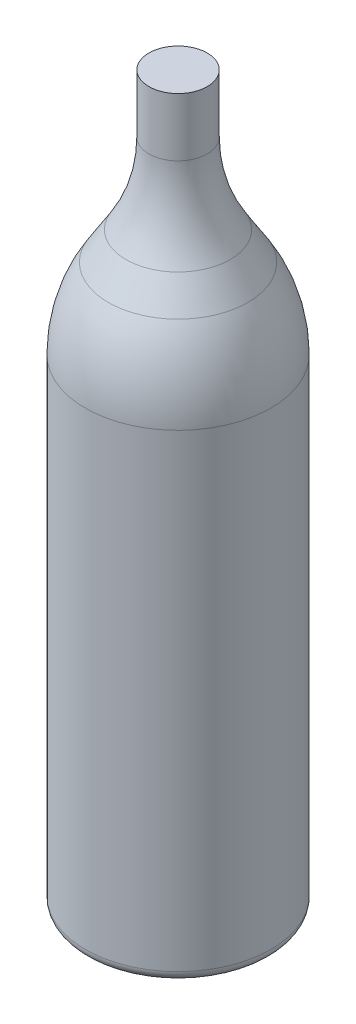
ISO-10303-21;
HEADER;
FILE_DESCRIPTION(('STEP AP214'),'2;1');
FILE_NAME('part.step','',(''),(''),'','','');
FILE_SCHEMA(('AUTOMOTIVE_DESIGN { 1 0 10303 214 1 1 1 1 }'));
ENDSEC;
DATA;
#1=APPLICATION_CONTEXT('core data for automotive mechanical design processes');
#2=APPLICATION_PROTOCOL_DEFINITION('international standard','automotive_design',2000,#1);
#3=PRODUCT_CONTEXT('',#1,'mechanical');
#4=PRODUCT('Part','Part','',(#3));
#5=PRODUCT_RELATED_PRODUCT_CATEGORY('part','',(#4));
#6=PRODUCT_DEFINITION_FORMATION('','',#4);
#7=PRODUCT_DEFINITION_CONTEXT('part definition',#1,'design');
#8=PRODUCT_DEFINITION('design','',#6,#7);
#9=PRODUCT_DEFINITION_SHAPE('','',#8);
#10=(LENGTH_UNIT() NAMED_UNIT(*) SI_UNIT(.MILLI.,.METRE.));
#11=(NAMED_UNIT(*) PLANE_ANGLE_UNIT() SI_UNIT($,.RADIAN.));
#12=(NAMED_UNIT(*) SI_UNIT($,.STERADIAN.) SOLID_ANGLE_UNIT());
#13=UNCERTAINTY_MEASURE_WITH_UNIT(LENGTH_MEASURE(1.E-05),#10,'distance_accuracy_value','');
#14=(GEOMETRIC_REPRESENTATION_CONTEXT(3) GLOBAL_UNCERTAINTY_ASSIGNED_CONTEXT((#13)) GLOBAL_UNIT_ASSIGNED_CONTEXT((#10,
#11,#12)) REPRESENTATION_CONTEXT('',''));
#15=CARTESIAN_POINT('',(0.,0.,0.));
#16=DIRECTION('',(0.,0.,1.));
#17=DIRECTION('',(1.,0.,0.));
#18=AXIS2_PLACEMENT_3D('',#15,#16,#17);
#19=CARTESIAN_POINT('',(0.,10.7696049141904,0.));
#20=DIRECTION('',(0.,-1.,0.));
#21=DIRECTION('',(-1.,0.,0.));
#22=AXIS2_PLACEMENT_3D('',#19,#20,#21);
#23=SPHERICAL_SURFACE('',#22,11.6870399867786);
#24=CARTESIAN_POINT('',(0.,18.9344835735498,0.));
#25=DIRECTION('',(0.,-1.,0.));
#26=DIRECTION('',(0.,0.,-1.));
#27=AXIS2_PLACEMENT_3D('',#24,#25,#26);
#28=CIRCLE('',#27,8.36191725207209);
#29=CARTESIAN_POINT('',(0.,18.9344835735498,-8.36191725207209));
#30=VERTEX_POINT('',#29);
#31=EDGE_CURVE('E10',#30,#30,#28,.T.);
#32=ORIENTED_EDGE('',*,*,#31,.T.);
#33=EDGE_LOOP('',(#32));
#34=FACE_BOUND('',#33,.T.);
#35=ADVANCED_FACE('F31',(#34),#23,.F.);
#36=CARTESIAN_POINT('',(0.,5.23055874861314,0.));
#37=DIRECTION('',(0.,-1.,0.));
#38=DIRECTION('',(0.,0.,-1.));
#39=AXIS2_PLACEMENT_3D('',#36,#37,#38);
#40=CONICAL_SURFACE('',#39,18.5771509345454,0.640565993951054);
#41=ORIENTED_EDGE('',*,*,#31,.F.);
#42=EDGE_LOOP('',(#41));
#43=FACE_BOUND('',#42,.T.);
#44=CARTESIAN_POINT('',(0.,5.23055874861314,0.));
#45=DIRECTION('',(0.,-1.,0.));
#46=DIRECTION('',(0.,0.,-1.));
#47=AXIS2_PLACEMENT_3D('',#44,#45,#46);
#48=CIRCLE('',#47,18.5771509345454);
#49=CARTESIAN_POINT('',(0.,5.23055874861314,-18.5771509345454));
#50=VERTEX_POINT('',#49);
#51=EDGE_CURVE('E37',#50,#50,#48,.T.);
#52=ORIENTED_EDGE('',*,*,#51,.T.);
#53=EDGE_LOOP('',(#52));
#54=FACE_BOUND('',#53,.T.);
#55=ADVANCED_FACE('F81',(#43,#54),#40,.F.);
#56=CARTESIAN_POINT('',(0.,13.,0.));
#57=DIRECTION('',(0.,-1.,0.));
#58=DIRECTION('',(0.,0.,-1.));
#59=AXIS2_PLACEMENT_3D('',#56,#57,#58);
#60=TOROIDAL_SURFACE('',#59,29.,13.);
#61=ORIENTED_EDGE('',*,*,#51,.F.);
#62=EDGE_LOOP('',(#61));
#63=FACE_BOUND('',#62,.T.);
#64=CARTESIAN_POINT('',(0.,0.,0.));
#65=DIRECTION('',(0.,-1.,0.));
#66=DIRECTION('',(0.,0.,-1.));
#67=AXIS2_PLACEMENT_3D('',#64,#65,#66);
#68=CIRCLE('',#67,29.);
#69=CARTESIAN_POINT('',(0.,0.,-29.));
#70=VERTEX_POINT('',#69);
#71=EDGE_CURVE('E41',#70,#70,#68,.T.);
#72=ORIENTED_EDGE('',*,*,#71,.T.);
#73=EDGE_LOOP('',(#72));
#74=FACE_BOUND('',#73,.T.);
#75=ADVANCED_FACE('F85',(#63,#74),#60,.T.);
#76=CARTESIAN_POINT('',(-31.,0.,0.));
#77=DIRECTION('',(0.,1.,0.));
#78=DIRECTION('',(0.,0.,1.));
#79=AXIS2_PLACEMENT_3D('',#76,#77,#78);
#80=PLANE('',#79);
#81=ORIENTED_EDGE('',*,*,#71,.F.);
#82=EDGE_LOOP('',(#81));
#83=FACE_BOUND('',#82,.T.);
#84=CARTESIAN_POINT('',(0.,0.,0.));
#85=DIRECTION('',(0.,-1.,0.));
#86=DIRECTION('',(0.,0.,-1.));
#87=AXIS2_PLACEMENT_3D('',#84,#85,#86);
#88=CIRCLE('',#87,31.);
#89=CARTESIAN_POINT('',(0.,0.,-31.));
#90=VERTEX_POINT('',#89);
#91=EDGE_CURVE('E45',#90,#90,#88,.T.);
#92=ORIENTED_EDGE('',*,*,#91,.T.);
#93=EDGE_LOOP('',(#92));
#94=FACE_BOUND('',#93,.T.);
#95=ADVANCED_FACE('F90',(#83,#94),#80,.F.);
#96=CARTESIAN_POINT('',(0.,4.,0.));
#97=DIRECTION('',(0.,-1.,0.));
#98=DIRECTION('',(0.,0.,-1.));
#99=AXIS2_PLACEMENT_3D('',#96,#97,#98);
#100=TOROIDAL_SURFACE('',#99,31.,4.);
#101=ORIENTED_EDGE('',*,*,#91,.F.);
#102=EDGE_LOOP('',(#101));
#103=FACE_BOUND('',#102,.T.);
#104=CARTESIAN_POINT('',(0.,4.00000000000003,0.));
#105=DIRECTION('',(0.,-1.,0.));
#106=DIRECTION('',(0.,0.,-1.));
#107=AXIS2_PLACEMENT_3D('',#104,#105,#106);
#108=CIRCLE('',#107,35.);
#109=CARTESIAN_POINT('',(0.,4.00000000000003,-35.));
#110=VERTEX_POINT('',#109);
#111=EDGE_CURVE('E50',#110,#110,#108,.T.);
#112=ORIENTED_EDGE('',*,*,#111,.T.);
#113=EDGE_LOOP('',(#112));
#114=FACE_BOUND('',#113,.T.);
#115=ADVANCED_FACE('F96',(#103,#114),#100,.T.);
#116=CARTESIAN_POINT('',(0.,0.,0.));
#117=DIRECTION('',(0.,-1.,0.));
#118=DIRECTION('',(0.,0.,-1.));
#119=AXIS2_PLACEMENT_3D('',#116,#117,#118);
#120=CYLINDRICAL_SURFACE('',#119,35.);
#121=ORIENTED_EDGE('',*,*,#111,.F.);
#122=EDGE_LOOP('',(#121));
#123=FACE_BOUND('',#122,.T.);
#124=CARTESIAN_POINT('',(0.,180.902997326511,0.));
#125=DIRECTION('',(0.,-1.,0.));
#126=DIRECTION('',(0.,0.,-1.));
#127=AXIS2_PLACEMENT_3D('',#124,#125,#126);
#128=CIRCLE('',#127,35.);
#129=CARTESIAN_POINT('',(0.,180.902997326511,-35.));
#130=VERTEX_POINT('',#129);
#131=EDGE_CURVE('E53',#130,#130,#128,.T.);
#132=ORIENTED_EDGE('',*,*,#131,.T.);
#133=EDGE_LOOP('',(#132));
#134=FACE_BOUND('',#133,.T.);
#135=ADVANCED_FACE('F100',(#123,#134),#120,.T.);
#136=CARTESIAN_POINT('',(0.,180.902997326511,0.));
#137=DIRECTION('',(0.,-1.,0.));
#138=DIRECTION('',(0.,0.,-1.));
#139=AXIS2_PLACEMENT_3D('',#136,#137,#138);
#140=DEGENERATE_TOROIDAL_SURFACE('',#139,22.,57.,.F.);
#141=ORIENTED_EDGE('',*,*,#131,.F.);
#142=EDGE_LOOP('',(#141));
#143=FACE_BOUND('',#142,.T.);
#144=CARTESIAN_POINT('',(0.,211.108395387803,0.));
#145=DIRECTION('',(0.,-1.,0.));
#146=DIRECTION('',(0.,0.,-1.));
#147=AXIS2_PLACEMENT_3D('',#144,#145,#146);
#148=CIRCLE('',#147,26.3387414809162);
#149=CARTESIAN_POINT('',(0.,211.108395387803,-26.3387414809162));
#150=VERTEX_POINT('',#149);
#151=EDGE_CURVE('E56',#150,#150,#148,.T.);
#152=ORIENTED_EDGE('',*,*,#151,.T.);
#153=EDGE_LOOP('',(#152));
#154=FACE_BOUND('',#153,.T.);
#155=ADVANCED_FACE('F104',(#143,#154),#140,.F.);
#156=CARTESIAN_POINT('',(0.,221.794601938707,0.));
#157=DIRECTION('',(0.,-1.,0.));
#158=DIRECTION('',(0.,0.,-1.));
#159=AXIS2_PLACEMENT_3D('',#156,#157,#158);
#160=CONICAL_SURFACE('',#159,19.6612585190837,0.558505360638185);
#161=ORIENTED_EDGE('',*,*,#151,.F.);
#162=EDGE_LOOP('',(#161));
#163=FACE_BOUND('',#162,.T.);
#164=CARTESIAN_POINT('',(0.,221.794601938707,0.));
#165=DIRECTION('',(0.,-1.,0.));
#166=DIRECTION('',(0.,0.,-1.));
#167=AXIS2_PLACEMENT_3D('',#164,#165,#166);
#168=CIRCLE('',#167,19.6612585190837);
#169=CARTESIAN_POINT('',(0.,221.794601938707,-19.6612585190837));
#170=VERTEX_POINT('',#169);
#171=EDGE_CURVE('E59',#170,#170,#168,.T.);
#172=ORIENTED_EDGE('',*,*,#171,.T.);
#173=EDGE_LOOP('',(#172));
#174=FACE_BOUND('',#173,.T.);
#175=ADVANCED_FACE('F108',(#163,#174),#160,.T.);
#176=CARTESIAN_POINT('',(0.,252.,0.));
#177=DIRECTION('',(0.,-1.,0.));
#178=DIRECTION('',(0.,0.,-1.));
#179=AXIS2_PLACEMENT_3D('',#176,#177,#178);
#180=TOROIDAL_SURFACE('',#179,68.,57.);
#181=ORIENTED_EDGE('',*,*,#171,.F.);
#182=EDGE_LOOP('',(#181));
#183=FACE_BOUND('',#182,.T.);
#184=CARTESIAN_POINT('',(0.,252.,0.));
#185=DIRECTION('',(0.,-1.,0.));
#186=DIRECTION('',(0.,0.,-1.));
#187=AXIS2_PLACEMENT_3D('',#184,#185,#186);
#188=CIRCLE('',#187,11.);
#189=CARTESIAN_POINT('',(0.,252.,-11.));
#190=VERTEX_POINT('',#189);
#191=EDGE_CURVE('E62',#190,#190,#188,.T.);
#192=ORIENTED_EDGE('',*,*,#191,.T.);
#193=EDGE_LOOP('',(#192));
#194=FACE_BOUND('',#193,.T.);
#195=ADVANCED_FACE('F77',(#183,#194),#180,.F.);
#196=CARTESIAN_POINT('',(0.,0.,0.));
#197=DIRECTION('',(0.,-1.,0.));
#198=DIRECTION('',(0.,0.,-1.));
#199=AXIS2_PLACEMENT_3D('',#196,#197,#198);
#200=CYLINDRICAL_SURFACE('',#199,11.);
#201=ORIENTED_EDGE('',*,*,#191,.F.);
#202=EDGE_LOOP('',(#201));
#203=FACE_BOUND('',#202,.T.);
#204=CARTESIAN_POINT('',(0.,274.,0.));
#205=DIRECTION('',(0.,-1.,0.));
#206=DIRECTION('',(0.,0.,-1.));
#207=AXIS2_PLACEMENT_3D('',#204,#205,#206);
#208=CIRCLE('',#207,11.);
#209=CARTESIAN_POINT('',(0.,274.,-11.));
#210=VERTEX_POINT('',#209);
#211=EDGE_CURVE('E65',#210,#210,#208,.T.);
#212=ORIENTED_EDGE('',*,*,#211,.T.);
#213=EDGE_LOOP('',(#212));
#214=FACE_BOUND('',#213,.T.);
#215=ADVANCED_FACE('F69',(#203,#214),#200,.T.);
#216=CARTESIAN_POINT('',(0.,274.,0.));
#217=DIRECTION('',(0.,-1.,0.));
#218=DIRECTION('',(0.,0.,-1.));
#219=AXIS2_PLACEMENT_3D('',#216,#217,#218);
#220=PLANE('',#219);
#221=ORIENTED_EDGE('',*,*,#211,.F.);
#222=EDGE_LOOP('',(#221));
#223=FACE_BOUND('',#222,.T.);
#224=ADVANCED_FACE('F71',(#223),#220,.F.);
#225=CLOSED_SHELL('',(#35,#55,#75,#95,#115,#135,#155,#175,#195,#215,#224));
#226=MANIFOLD_SOLID_BREP('B2',#225);
#227=ADVANCED_BREP_SHAPE_REPRESENTATION('',(#18,#226),#14);
#228=SHAPE_DEFINITION_REPRESENTATION(#9,#227);
ENDSEC;
END-ISO-10303-21;
